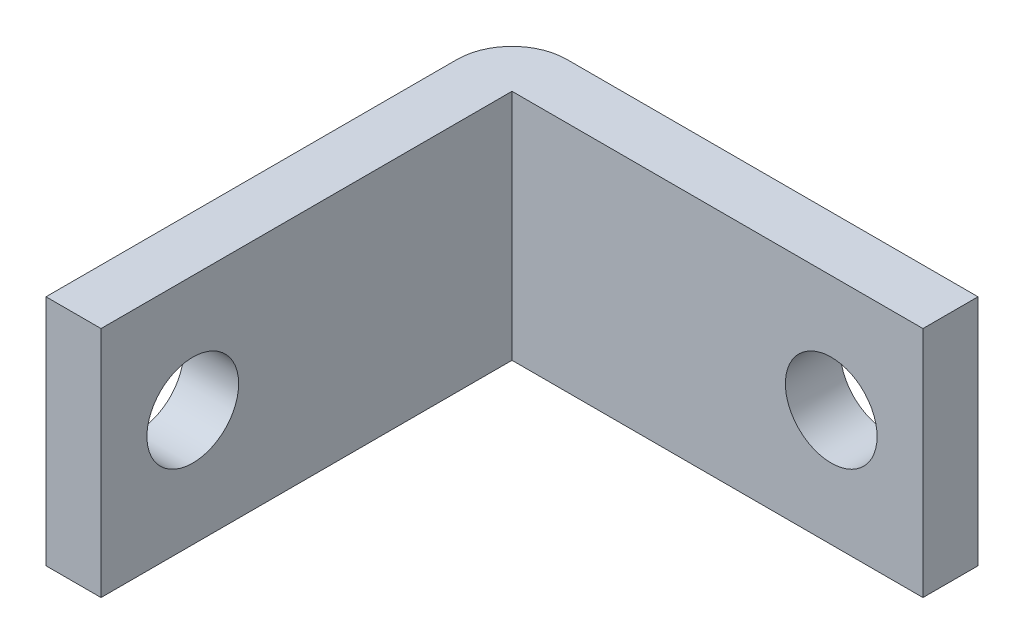
ISO-10303-21;
HEADER;
FILE_DESCRIPTION(('STEP AP214'),'2;1');
FILE_NAME('part.step','',(''),(''),'','','');
FILE_SCHEMA(('AUTOMOTIVE_DESIGN { 1 0 10303 214 1 1 1 1 }'));
ENDSEC;
DATA;
#1=APPLICATION_CONTEXT('core data for automotive mechanical design processes');
#2=APPLICATION_PROTOCOL_DEFINITION('international standard','automotive_design',2000,#1);
#3=PRODUCT_CONTEXT('',#1,'mechanical');
#4=PRODUCT('Part','Part','',(#3));
#5=PRODUCT_RELATED_PRODUCT_CATEGORY('part','',(#4));
#6=PRODUCT_DEFINITION_FORMATION('','',#4);
#7=PRODUCT_DEFINITION_CONTEXT('part definition',#1,'design');
#8=PRODUCT_DEFINITION('design','',#6,#7);
#9=PRODUCT_DEFINITION_SHAPE('','',#8);
#10=(LENGTH_UNIT() NAMED_UNIT(*) SI_UNIT(.MILLI.,.METRE.));
#11=(NAMED_UNIT(*) PLANE_ANGLE_UNIT() SI_UNIT($,.RADIAN.));
#12=(NAMED_UNIT(*) SI_UNIT($,.STERADIAN.) SOLID_ANGLE_UNIT());
#13=UNCERTAINTY_MEASURE_WITH_UNIT(LENGTH_MEASURE(1.E-05),#10,'distance_accuracy_value','');
#14=(GEOMETRIC_REPRESENTATION_CONTEXT(3) GLOBAL_UNCERTAINTY_ASSIGNED_CONTEXT((#13)) GLOBAL_UNIT_ASSIGNED_CONTEXT((#10,
#11,#12)) REPRESENTATION_CONTEXT('',''));
#15=CARTESIAN_POINT('',(0.,0.,0.));
#16=DIRECTION('',(0.,0.,1.));
#17=DIRECTION('',(1.,0.,0.));
#18=AXIS2_PLACEMENT_3D('',#15,#16,#17);
#19=CARTESIAN_POINT('',(0.,0.,40.));
#20=DIRECTION('',(1.,0.,0.));
#21=DIRECTION('',(0.,0.,-1.));
#22=AXIS2_PLACEMENT_3D('',#19,#20,#21);
#23=PLANE('',#22);
#24=CARTESIAN_POINT('',(0.,6.35,20.4));
#25=DIRECTION('',(1.,0.,0.));
#26=DIRECTION('',(0.,0.,-1.));
#27=AXIS2_PLACEMENT_3D('',#24,#25,#26);
#28=CIRCLE('',#27,2.5);
#29=CARTESIAN_POINT('',(0.,6.35,17.9));
#30=VERTEX_POINT('',#29);
#31=EDGE_CURVE('E118',#30,#30,#28,.T.);
#32=ORIENTED_EDGE('',*,*,#31,.T.);
#33=EDGE_LOOP('',(#32));
#34=FACE_BOUND('',#33,.T.);
#35=DIRECTION('',(0.,1.,0.));
#36=VECTOR('',#35,1.);
#37=CARTESIAN_POINT('',(0.,-17.3,25.4));
#38=LINE('',#37,#36);
#39=CARTESIAN_POINT('',(0.,0.,25.4));
#40=VERTEX_POINT('',#39);
#41=CARTESIAN_POINT('',(0.,12.7,25.4));
#42=VERTEX_POINT('',#41);
#43=EDGE_CURVE('E104',#40,#42,#38,.T.);
#44=ORIENTED_EDGE('',*,*,#43,.T.);
#45=DIRECTION('',(0.,0.,-1.));
#46=VECTOR('',#45,1.);
#47=CARTESIAN_POINT('',(0.,12.7,40.));
#48=LINE('',#47,#46);
#49=CARTESIAN_POINT('',(0.,12.7,3.));
#50=VERTEX_POINT('',#49);
#51=EDGE_CURVE('E113',#42,#50,#48,.T.);
#52=ORIENTED_EDGE('',*,*,#51,.T.);
#53=DIRECTION('',(0.,1.,0.));
#54=VECTOR('',#53,1.);
#55=CARTESIAN_POINT('',(0.,-17.3,3.));
#56=LINE('',#55,#54);
#57=CARTESIAN_POINT('',(0.,0.,3.));
#58=VERTEX_POINT('',#57);
#59=EDGE_CURVE('E95',#58,#50,#56,.T.);
#60=ORIENTED_EDGE('',*,*,#59,.F.);
#61=DIRECTION('',(0.,0.,-1.));
#62=VECTOR('',#61,1.);
#63=CARTESIAN_POINT('',(0.,0.,40.));
#64=LINE('',#63,#62);
#65=EDGE_CURVE('E46',#40,#58,#64,.T.);
#66=ORIENTED_EDGE('',*,*,#65,.F.);
#67=EDGE_LOOP('',(#44,#52,#60,#66));
#68=FACE_BOUND('',#67,.T.);
#69=ADVANCED_FACE('F38',(#34,#68),#23,.F.);
#70=CARTESIAN_POINT('',(0.,0.,40.));
#71=DIRECTION('',(0.,1.,0.));
#72=DIRECTION('',(0.,0.,1.));
#73=AXIS2_PLACEMENT_3D('',#70,#71,#72);
#74=PLANE('',#73);
#75=DIRECTION('',(1.,0.,0.));
#76=VECTOR('',#75,1.);
#77=CARTESIAN_POINT('',(0.,0.,3.));
#78=LINE('',#77,#76);
#79=CARTESIAN_POINT('',(3.,0.,3.));
#80=VERTEX_POINT('',#79);
#81=CARTESIAN_POINT('',(25.4,0.,3.));
#82=VERTEX_POINT('',#81);
#83=EDGE_CURVE('E148',#80,#82,#78,.T.);
#84=ORIENTED_EDGE('',*,*,#83,.F.);
#85=DIRECTION('',(0.,0.,-1.));
#86=VECTOR('',#85,1.);
#87=CARTESIAN_POINT('',(3.,0.,40.));
#88=LINE('',#87,#86);
#89=CARTESIAN_POINT('',(3.,0.,25.4));
#90=VERTEX_POINT('',#89);
#91=EDGE_CURVE('E142',#90,#80,#88,.T.);
#92=ORIENTED_EDGE('',*,*,#91,.F.);
#93=DIRECTION('',(1.,0.,0.));
#94=VECTOR('',#93,1.);
#95=CARTESIAN_POINT('',(0.,0.,25.4));
#96=LINE('',#95,#94);
#97=EDGE_CURVE('E141',#40,#90,#96,.T.);
#98=ORIENTED_EDGE('',*,*,#97,.F.);
#99=ORIENTED_EDGE('',*,*,#65,.T.);
#100=CARTESIAN_POINT('',(3.,0.,3.));
#101=DIRECTION('',(0.,1.,0.));
#102=DIRECTION('',(0.,0.,1.));
#103=AXIS2_PLACEMENT_3D('',#100,#101,#102);
#104=CIRCLE('',#103,3.);
#105=CARTESIAN_POINT('',(3.,0.,0.));
#106=VERTEX_POINT('',#105);
#107=EDGE_CURVE('E98',#106,#58,#104,.T.);
#108=ORIENTED_EDGE('',*,*,#107,.F.);
#109=DIRECTION('',(1.,0.,0.));
#110=VECTOR('',#109,1.);
#111=CARTESIAN_POINT('',(0.,0.,0.));
#112=LINE('',#111,#110);
#113=CARTESIAN_POINT('',(25.4,0.,0.));
#114=VERTEX_POINT('',#113);
#115=EDGE_CURVE('E155',#106,#114,#112,.T.);
#116=ORIENTED_EDGE('',*,*,#115,.T.);
#117=DIRECTION('',(0.,0.,-1.));
#118=VECTOR('',#117,1.);
#119=CARTESIAN_POINT('',(25.4,0.,40.));
#120=LINE('',#119,#118);
#121=EDGE_CURVE('E126',#82,#114,#120,.T.);
#122=ORIENTED_EDGE('',*,*,#121,.F.);
#123=EDGE_LOOP('',(#84,#92,#98,#99,#108,#116,#122));
#124=FACE_BOUND('',#123,.T.);
#125=ADVANCED_FACE('F137',(#124),#74,.F.);
#126=CARTESIAN_POINT('',(25.4,0.,40.));
#127=DIRECTION('',(-1.,0.,0.));
#128=DIRECTION('',(0.,0.,1.));
#129=AXIS2_PLACEMENT_3D('',#126,#127,#128);
#130=PLANE('',#129);
#131=DIRECTION('',(0.,1.,0.));
#132=VECTOR('',#131,1.);
#133=CARTESIAN_POINT('',(25.4,-17.3,3.));
#134=LINE('',#133,#132);
#135=CARTESIAN_POINT('',(25.4,12.7,3.));
#136=VERTEX_POINT('',#135);
#137=EDGE_CURVE('E150',#82,#136,#134,.T.);
#138=ORIENTED_EDGE('',*,*,#137,.F.);
#139=ORIENTED_EDGE('',*,*,#121,.T.);
#140=DIRECTION('',(0.,1.,0.));
#141=VECTOR('',#140,1.);
#142=CARTESIAN_POINT('',(25.4,0.,0.));
#143=LINE('',#142,#141);
#144=CARTESIAN_POINT('',(25.4,12.7,0.));
#145=VERTEX_POINT('',#144);
#146=EDGE_CURVE('E128',#114,#145,#143,.T.);
#147=ORIENTED_EDGE('',*,*,#146,.T.);
#148=DIRECTION('',(0.,0.,-1.));
#149=VECTOR('',#148,1.);
#150=CARTESIAN_POINT('',(25.4,12.7,40.));
#151=LINE('',#150,#149);
#152=EDGE_CURVE('E122',#136,#145,#151,.T.);
#153=ORIENTED_EDGE('',*,*,#152,.F.);
#154=EDGE_LOOP('',(#138,#139,#147,#153));
#155=FACE_BOUND('',#154,.T.);
#156=ADVANCED_FACE('F163',(#155),#130,.F.);
#157=CARTESIAN_POINT('',(0.,12.7,40.));
#158=DIRECTION('',(0.,-1.,0.));
#159=DIRECTION('',(0.,0.,-1.));
#160=AXIS2_PLACEMENT_3D('',#157,#158,#159);
#161=PLANE('',#160);
#162=DIRECTION('',(1.,0.,0.));
#163=VECTOR('',#162,1.);
#164=CARTESIAN_POINT('',(25.4,12.7,3.));
#165=LINE('',#164,#163);
#166=CARTESIAN_POINT('',(3.,12.7,3.));
#167=VERTEX_POINT('',#166);
#168=EDGE_CURVE('E105',#167,#136,#165,.T.);
#169=ORIENTED_EDGE('',*,*,#168,.T.);
#170=ORIENTED_EDGE('',*,*,#152,.T.);
#171=DIRECTION('',(-1.,0.,0.));
#172=VECTOR('',#171,1.);
#173=CARTESIAN_POINT('',(0.,12.7,0.));
#174=LINE('',#173,#172);
#175=CARTESIAN_POINT('',(3.,12.7,0.));
#176=VERTEX_POINT('',#175);
#177=EDGE_CURVE('E115',#145,#176,#174,.T.);
#178=ORIENTED_EDGE('',*,*,#177,.T.);
#179=CARTESIAN_POINT('',(3.,12.7,3.));
#180=DIRECTION('',(0.,1.,0.));
#181=DIRECTION('',(0.,0.,-1.));
#182=AXIS2_PLACEMENT_3D('',#179,#180,#181);
#183=CIRCLE('',#182,3.);
#184=EDGE_CURVE('E61',#176,#50,#183,.T.);
#185=ORIENTED_EDGE('',*,*,#184,.T.);
#186=ORIENTED_EDGE('',*,*,#51,.F.);
#187=DIRECTION('',(1.,0.,0.));
#188=VECTOR('',#187,1.);
#189=CARTESIAN_POINT('',(0.,12.7,25.4));
#190=LINE('',#189,#188);
#191=CARTESIAN_POINT('',(3.,12.7,25.4));
#192=VERTEX_POINT('',#191);
#193=EDGE_CURVE('E117',#42,#192,#190,.T.);
#194=ORIENTED_EDGE('',*,*,#193,.T.);
#195=DIRECTION('',(0.,0.,-1.));
#196=VECTOR('',#195,1.);
#197=CARTESIAN_POINT('',(3.,12.7,25.4));
#198=LINE('',#197,#196);
#199=EDGE_CURVE('E53',#192,#167,#198,.T.);
#200=ORIENTED_EDGE('',*,*,#199,.T.);
#201=EDGE_LOOP('',(#169,#170,#178,#185,#186,#194,#200));
#202=FACE_BOUND('',#201,.T.);
#203=ADVANCED_FACE('F111',(#202),#161,.F.);
#204=CARTESIAN_POINT('',(0.,0.,0.));
#205=DIRECTION('',(0.,0.,-1.));
#206=DIRECTION('',(-1.,0.,0.));
#207=AXIS2_PLACEMENT_3D('',#204,#205,#206);
#208=PLANE('',#207);
#209=CARTESIAN_POINT('',(20.4,6.35,0.));
#210=DIRECTION('',(0.,0.,-1.));
#211=DIRECTION('',(-1.,0.,0.));
#212=AXIS2_PLACEMENT_3D('',#209,#210,#211);
#213=CIRCLE('',#212,2.5);
#214=CARTESIAN_POINT('',(17.9,6.35,0.));
#215=VERTEX_POINT('',#214);
#216=EDGE_CURVE('E194',#215,#215,#213,.T.);
#217=ORIENTED_EDGE('',*,*,#216,.F.);
#218=EDGE_LOOP('',(#217));
#219=FACE_BOUND('',#218,.T.);
#220=ORIENTED_EDGE('',*,*,#115,.F.);
#221=DIRECTION('',(0.,1.,0.));
#222=VECTOR('',#221,1.);
#223=CARTESIAN_POINT('',(3.,-17.3,0.));
#224=LINE('',#223,#222);
#225=EDGE_CURVE('E11',#106,#176,#224,.T.);
#226=ORIENTED_EDGE('',*,*,#225,.T.);
#227=ORIENTED_EDGE('',*,*,#177,.F.);
#228=ORIENTED_EDGE('',*,*,#146,.F.);
#229=EDGE_LOOP('',(#220,#226,#227,#228));
#230=FACE_BOUND('',#229,.T.);
#231=ADVANCED_FACE('F166',(#219,#230),#208,.T.);
#232=CARTESIAN_POINT('',(3.,-17.3,3.));
#233=DIRECTION('',(0.,1.,0.));
#234=DIRECTION('',(0.,0.,1.));
#235=AXIS2_PLACEMENT_3D('',#232,#233,#234);
#236=CYLINDRICAL_SURFACE('',#235,3.);
#237=ORIENTED_EDGE('',*,*,#107,.T.);
#238=ORIENTED_EDGE('',*,*,#59,.T.);
#239=ORIENTED_EDGE('',*,*,#184,.F.);
#240=ORIENTED_EDGE('',*,*,#225,.F.);
#241=EDGE_LOOP('',(#237,#238,#239,#240));
#242=FACE_BOUND('',#241,.T.);
#243=ADVANCED_FACE('F96',(#242),#236,.T.);
#244=CARTESIAN_POINT('',(25.4,-17.3,3.));
#245=DIRECTION('',(0.,0.,1.));
#246=DIRECTION('',(1.,0.,0.));
#247=AXIS2_PLACEMENT_3D('',#244,#245,#246);
#248=PLANE('',#247);
#249=CARTESIAN_POINT('',(20.4,6.35,3.));
#250=DIRECTION('',(0.,0.,1.));
#251=DIRECTION('',(1.,0.,0.));
#252=AXIS2_PLACEMENT_3D('',#249,#250,#251);
#253=CIRCLE('',#252,2.5);
#254=CARTESIAN_POINT('',(22.9,6.35,3.));
#255=VERTEX_POINT('',#254);
#256=EDGE_CURVE('E198',#255,#255,#253,.T.);
#257=ORIENTED_EDGE('',*,*,#256,.F.);
#258=EDGE_LOOP('',(#257));
#259=FACE_BOUND('',#258,.T.);
#260=ORIENTED_EDGE('',*,*,#83,.T.);
#261=ORIENTED_EDGE('',*,*,#137,.T.);
#262=ORIENTED_EDGE('',*,*,#168,.F.);
#263=DIRECTION('',(0.,1.,0.));
#264=VECTOR('',#263,1.);
#265=CARTESIAN_POINT('',(3.,-17.3,3.));
#266=LINE('',#265,#264);
#267=EDGE_CURVE('E171',#80,#167,#266,.T.);
#268=ORIENTED_EDGE('',*,*,#267,.F.);
#269=EDGE_LOOP('',(#260,#261,#262,#268));
#270=FACE_BOUND('',#269,.T.);
#271=ADVANCED_FACE('F169',(#259,#270),#248,.T.);
#272=CARTESIAN_POINT('',(3.,-17.3,25.4));
#273=DIRECTION('',(1.,0.,0.));
#274=DIRECTION('',(0.,0.,-1.));
#275=AXIS2_PLACEMENT_3D('',#272,#273,#274);
#276=PLANE('',#275);
#277=CARTESIAN_POINT('',(3.,6.35,20.4));
#278=DIRECTION('',(1.,0.,0.));
#279=DIRECTION('',(0.,0.,-1.));
#280=AXIS2_PLACEMENT_3D('',#277,#278,#279);
#281=CIRCLE('',#280,2.5);
#282=CARTESIAN_POINT('',(3.,6.35,17.9));
#283=VERTEX_POINT('',#282);
#284=EDGE_CURVE('E190',#283,#283,#281,.T.);
#285=ORIENTED_EDGE('',*,*,#284,.F.);
#286=EDGE_LOOP('',(#285));
#287=FACE_BOUND('',#286,.T.);
#288=ORIENTED_EDGE('',*,*,#91,.T.);
#289=ORIENTED_EDGE('',*,*,#267,.T.);
#290=ORIENTED_EDGE('',*,*,#199,.F.);
#291=DIRECTION('',(0.,1.,0.));
#292=VECTOR('',#291,1.);
#293=CARTESIAN_POINT('',(3.,-17.3,25.4));
#294=LINE('',#293,#292);
#295=EDGE_CURVE('E175',#90,#192,#294,.T.);
#296=ORIENTED_EDGE('',*,*,#295,.F.);
#297=EDGE_LOOP('',(#288,#289,#290,#296));
#298=FACE_BOUND('',#297,.T.);
#299=ADVANCED_FACE('F207',(#287,#298),#276,.T.);
#300=CARTESIAN_POINT('',(0.,-17.3,25.4));
#301=DIRECTION('',(0.,0.,1.));
#302=DIRECTION('',(1.,0.,0.));
#303=AXIS2_PLACEMENT_3D('',#300,#301,#302);
#304=PLANE('',#303);
#305=ORIENTED_EDGE('',*,*,#97,.T.);
#306=ORIENTED_EDGE('',*,*,#295,.T.);
#307=ORIENTED_EDGE('',*,*,#193,.F.);
#308=ORIENTED_EDGE('',*,*,#43,.F.);
#309=EDGE_LOOP('',(#305,#306,#307,#308));
#310=FACE_BOUND('',#309,.T.);
#311=ADVANCED_FACE('F213',(#310),#304,.T.);
#312=CARTESIAN_POINT('',(-27.,6.35,20.4));
#313=DIRECTION('',(1.,0.,0.));
#314=DIRECTION('',(0.,0.,-1.));
#315=AXIS2_PLACEMENT_3D('',#312,#313,#314);
#316=CYLINDRICAL_SURFACE('',#315,2.5);
#317=ORIENTED_EDGE('',*,*,#284,.T.);
#318=EDGE_LOOP('',(#317));
#319=FACE_BOUND('',#318,.T.);
#320=ORIENTED_EDGE('',*,*,#31,.F.);
#321=EDGE_LOOP('',(#320));
#322=FACE_BOUND('',#321,.T.);
#323=ADVANCED_FACE('F225',(#319,#322),#316,.F.);
#324=CARTESIAN_POINT('',(20.4,6.35,-27.));
#325=DIRECTION('',(0.,0.,1.));
#326=DIRECTION('',(1.,0.,0.));
#327=AXIS2_PLACEMENT_3D('',#324,#325,#326);
#328=CYLINDRICAL_SURFACE('',#327,2.5);
#329=ORIENTED_EDGE('',*,*,#216,.T.);
#330=EDGE_LOOP('',(#329));
#331=FACE_BOUND('',#330,.T.);
#332=ORIENTED_EDGE('',*,*,#256,.T.);
#333=EDGE_LOOP('',(#332));
#334=FACE_BOUND('',#333,.T.);
#335=ADVANCED_FACE('F204',(#331,#334),#328,.F.);
#336=CLOSED_SHELL('',(#69,#125,#156,#203,#231,#243,#271,#299,#311,#323,#335));
#337=MANIFOLD_SOLID_BREP('B2',#336);
#338=ADVANCED_BREP_SHAPE_REPRESENTATION('',(#18,#337),#14);
#339=SHAPE_DEFINITION_REPRESENTATION(#9,#338);
ENDSEC;
END-ISO-10303-21;
